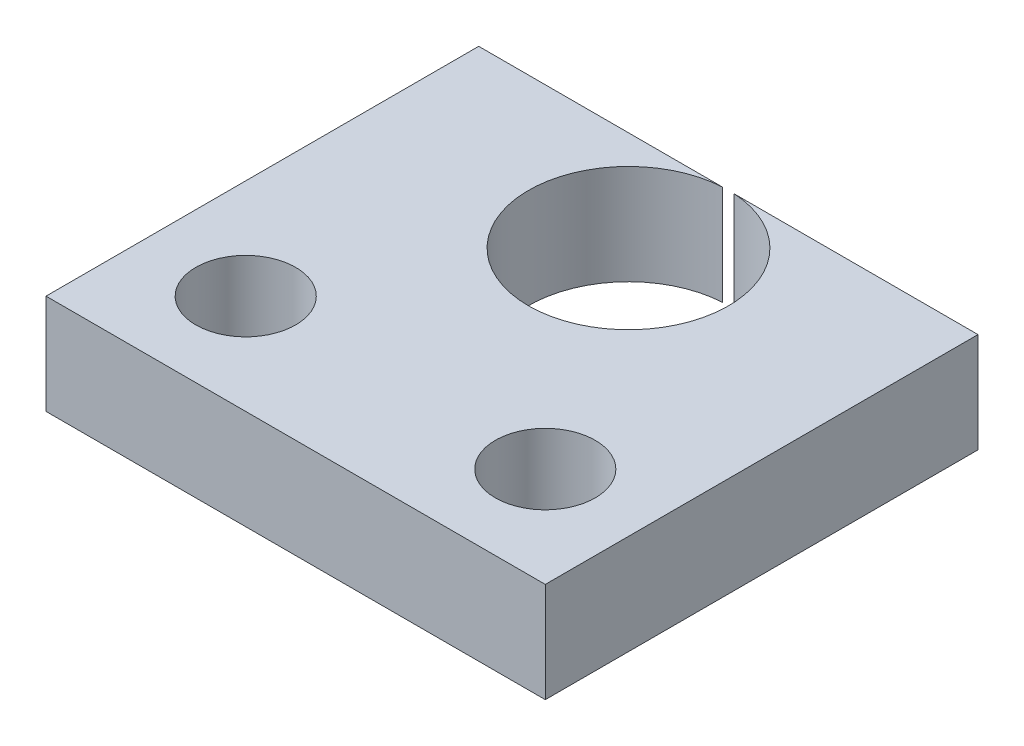
ISO-10303-21;
HEADER;
FILE_DESCRIPTION(('STEP AP214'),'2;1');
FILE_NAME('part.step','',(''),(''),'','','');
FILE_SCHEMA(('AUTOMOTIVE_DESIGN { 1 0 10303 214 1 1 1 1 }'));
ENDSEC;
DATA;
#1=APPLICATION_CONTEXT('core data for automotive mechanical design processes');
#2=APPLICATION_PROTOCOL_DEFINITION('international standard','automotive_design',2000,#1);
#3=PRODUCT_CONTEXT('',#1,'mechanical');
#4=PRODUCT('Part','Part','',(#3));
#5=PRODUCT_RELATED_PRODUCT_CATEGORY('part','',(#4));
#6=PRODUCT_DEFINITION_FORMATION('','',#4);
#7=PRODUCT_DEFINITION_CONTEXT('part definition',#1,'design');
#8=PRODUCT_DEFINITION('design','',#6,#7);
#9=PRODUCT_DEFINITION_SHAPE('','',#8);
#10=(LENGTH_UNIT() NAMED_UNIT(*) SI_UNIT(.MILLI.,.METRE.));
#11=(NAMED_UNIT(*) PLANE_ANGLE_UNIT() SI_UNIT($,.RADIAN.));
#12=(NAMED_UNIT(*) SI_UNIT($,.STERADIAN.) SOLID_ANGLE_UNIT());
#13=UNCERTAINTY_MEASURE_WITH_UNIT(LENGTH_MEASURE(1.E-05),#10,'distance_accuracy_value','');
#14=(GEOMETRIC_REPRESENTATION_CONTEXT(3) GLOBAL_UNCERTAINTY_ASSIGNED_CONTEXT((#13)) GLOBAL_UNIT_ASSIGNED_CONTEXT((#10,
#11,#12)) REPRESENTATION_CONTEXT('',''));
#15=CARTESIAN_POINT('',(0.,0.,0.));
#16=DIRECTION('',(0.,0.,1.));
#17=DIRECTION('',(1.,0.,0.));
#18=AXIS2_PLACEMENT_3D('',#15,#16,#17);
#19=CARTESIAN_POINT('',(-7.5,3.,-7.));
#20=DIRECTION('',(0.,0.,1.));
#21=DIRECTION('',(1.,0.,0.));
#22=AXIS2_PLACEMENT_3D('',#19,#20,#21);
#23=PLANE('',#22);
#24=DIRECTION('',(-1.,0.,0.));
#25=VECTOR('',#24,1.);
#26=CARTESIAN_POINT('',(-7.5,0.,-7.));
#27=LINE('',#26,#25);
#28=CARTESIAN_POINT('',(7.5,0.,-7.));
#29=VERTEX_POINT('',#28);
#30=CARTESIAN_POINT('',(0.173277234511575,0.,-7.));
#31=VERTEX_POINT('',#30);
#32=EDGE_CURVE('E106',#29,#31,#27,.T.);
#33=ORIENTED_EDGE('',*,*,#32,.T.);
#34=DIRECTION('',(0.,1.,0.));
#35=VECTOR('',#34,1.);
#36=CARTESIAN_POINT('',(0.173277234511575,0.,-7.));
#37=LINE('',#36,#35);
#38=CARTESIAN_POINT('',(0.173277234511575,3.,-7.));
#39=VERTEX_POINT('',#38);
#40=EDGE_CURVE('E50',#31,#39,#37,.T.);
#41=ORIENTED_EDGE('',*,*,#40,.T.);
#42=DIRECTION('',(-1.,0.,0.));
#43=VECTOR('',#42,1.);
#44=CARTESIAN_POINT('',(-7.5,3.,-7.));
#45=LINE('',#44,#43);
#46=CARTESIAN_POINT('',(7.5,3.,-7.));
#47=VERTEX_POINT('',#46);
#48=EDGE_CURVE('E128',#47,#39,#45,.T.);
#49=ORIENTED_EDGE('',*,*,#48,.F.);
#50=DIRECTION('',(0.,-1.,0.));
#51=VECTOR('',#50,1.);
#52=CARTESIAN_POINT('',(7.5,3.,-7.));
#53=LINE('',#52,#51);
#54=EDGE_CURVE('E153',#47,#29,#53,.T.);
#55=ORIENTED_EDGE('',*,*,#54,.T.);
#56=EDGE_LOOP('',(#33,#41,#49,#55));
#57=FACE_BOUND('',#56,.T.);
#58=ADVANCED_FACE('F32',(#57),#23,.F.);
#59=CARTESIAN_POINT('',(-7.5,3.,-7.));
#60=DIRECTION('',(1.,0.,0.));
#61=DIRECTION('',(0.,0.,-1.));
#62=AXIS2_PLACEMENT_3D('',#59,#60,#61);
#63=PLANE('',#62);
#64=DIRECTION('',(0.,0.,1.));
#65=VECTOR('',#64,1.);
#66=CARTESIAN_POINT('',(-7.5,0.,-7.));
#67=LINE('',#66,#65);
#68=CARTESIAN_POINT('',(-7.5,0.,-7.));
#69=VERTEX_POINT('',#68);
#70=CARTESIAN_POINT('',(-7.5,0.,6.));
#71=VERTEX_POINT('',#70);
#72=EDGE_CURVE('E105',#69,#71,#67,.T.);
#73=ORIENTED_EDGE('',*,*,#72,.T.);
#74=DIRECTION('',(0.,-1.,0.));
#75=VECTOR('',#74,1.);
#76=CARTESIAN_POINT('',(-7.5,3.,6.));
#77=LINE('',#76,#75);
#78=CARTESIAN_POINT('',(-7.5,3.,6.));
#79=VERTEX_POINT('',#78);
#80=EDGE_CURVE('E42',#79,#71,#77,.T.);
#81=ORIENTED_EDGE('',*,*,#80,.F.);
#82=DIRECTION('',(0.,0.,1.));
#83=VECTOR('',#82,1.);
#84=CARTESIAN_POINT('',(-7.5,3.,-7.));
#85=LINE('',#84,#83);
#86=CARTESIAN_POINT('',(-7.5,3.,-7.));
#87=VERTEX_POINT('',#86);
#88=EDGE_CURVE('E108',#87,#79,#85,.T.);
#89=ORIENTED_EDGE('',*,*,#88,.F.);
#90=DIRECTION('',(0.,-1.,0.));
#91=VECTOR('',#90,1.);
#92=CARTESIAN_POINT('',(-7.5,3.,-7.));
#93=LINE('',#92,#91);
#94=EDGE_CURVE('E120',#87,#69,#93,.T.);
#95=ORIENTED_EDGE('',*,*,#94,.T.);
#96=EDGE_LOOP('',(#73,#81,#89,#95));
#97=FACE_BOUND('',#96,.T.);
#98=ADVANCED_FACE('F34',(#97),#63,.F.);
#99=CARTESIAN_POINT('',(-7.5,3.,6.));
#100=DIRECTION('',(0.,0.,-1.));
#101=DIRECTION('',(-1.,0.,0.));
#102=AXIS2_PLACEMENT_3D('',#99,#100,#101);
#103=PLANE('',#102);
#104=DIRECTION('',(1.,0.,0.));
#105=VECTOR('',#104,1.);
#106=CARTESIAN_POINT('',(-7.5,0.,6.));
#107=LINE('',#106,#105);
#108=CARTESIAN_POINT('',(7.5,0.,6.));
#109=VERTEX_POINT('',#108);
#110=EDGE_CURVE('E109',#71,#109,#107,.T.);
#111=ORIENTED_EDGE('',*,*,#110,.T.);
#112=DIRECTION('',(0.,-1.,0.));
#113=VECTOR('',#112,1.);
#114=CARTESIAN_POINT('',(7.5,3.,6.));
#115=LINE('',#114,#113);
#116=CARTESIAN_POINT('',(7.5,3.,6.));
#117=VERTEX_POINT('',#116);
#118=EDGE_CURVE('E155',#117,#109,#115,.T.);
#119=ORIENTED_EDGE('',*,*,#118,.F.);
#120=DIRECTION('',(1.,0.,0.));
#121=VECTOR('',#120,1.);
#122=CARTESIAN_POINT('',(-7.5,3.,6.));
#123=LINE('',#122,#121);
#124=EDGE_CURVE('E87',#79,#117,#123,.T.);
#125=ORIENTED_EDGE('',*,*,#124,.F.);
#126=ORIENTED_EDGE('',*,*,#80,.T.);
#127=EDGE_LOOP('',(#111,#119,#125,#126));
#128=FACE_BOUND('',#127,.T.);
#129=ADVANCED_FACE('F157',(#128),#103,.F.);
#130=CARTESIAN_POINT('',(7.5,3.,-7.));
#131=DIRECTION('',(-1.,0.,0.));
#132=DIRECTION('',(0.,0.,1.));
#133=AXIS2_PLACEMENT_3D('',#130,#131,#132);
#134=PLANE('',#133);
#135=DIRECTION('',(0.,0.,-1.));
#136=VECTOR('',#135,1.);
#137=CARTESIAN_POINT('',(7.5,0.,-7.));
#138=LINE('',#137,#136);
#139=EDGE_CURVE('E107',#109,#29,#138,.T.);
#140=ORIENTED_EDGE('',*,*,#139,.T.);
#141=ORIENTED_EDGE('',*,*,#54,.F.);
#142=DIRECTION('',(0.,0.,-1.));
#143=VECTOR('',#142,1.);
#144=CARTESIAN_POINT('',(7.5,3.,-7.));
#145=LINE('',#144,#143);
#146=EDGE_CURVE('E129',#117,#47,#145,.T.);
#147=ORIENTED_EDGE('',*,*,#146,.F.);
#148=ORIENTED_EDGE('',*,*,#118,.T.);
#149=EDGE_LOOP('',(#140,#141,#147,#148));
#150=FACE_BOUND('',#149,.T.);
#151=ADVANCED_FACE('F154',(#150),#134,.F.);
#152=CARTESIAN_POINT('',(-0.173277234511575,3.,-7.));
#153=VERTEX_POINT('',#152);
#154=EDGE_CURVE('E58',#153,#87,#45,.T.);
#155=ORIENTED_EDGE('',*,*,#154,.F.);
#156=DIRECTION('',(0.,1.,0.));
#157=VECTOR('',#156,1.);
#158=CARTESIAN_POINT('',(-0.173277234511575,0.,-7.));
#159=LINE('',#158,#157);
#160=CARTESIAN_POINT('',(-0.173277234511575,0.,-7.));
#161=VERTEX_POINT('',#160);
#162=EDGE_CURVE('E95',#153,#161,#159,.F.);
#163=ORIENTED_EDGE('',*,*,#162,.T.);
#164=EDGE_CURVE('E36',#161,#69,#27,.T.);
#165=ORIENTED_EDGE('',*,*,#164,.T.);
#166=ORIENTED_EDGE('',*,*,#94,.F.);
#167=EDGE_LOOP('',(#155,#163,#165,#166));
#168=FACE_BOUND('',#167,.T.);
#169=ADVANCED_FACE('F99',(#168),#23,.F.);
#170=CARTESIAN_POINT('',(0.,3.,0.));
#171=DIRECTION('',(0.,1.,0.));
#172=DIRECTION('',(0.,0.,1.));
#173=AXIS2_PLACEMENT_3D('',#170,#171,#172);
#174=PLANE('',#173);
#175=CARTESIAN_POINT('',(4.5,3.,3.));
#176=DIRECTION('',(0.,1.,0.));
#177=DIRECTION('',(0.,0.,1.));
#178=AXIS2_PLACEMENT_3D('',#175,#176,#177);
#179=CIRCLE('',#178,1.5);
#180=CARTESIAN_POINT('',(4.5,3.,4.5));
#181=VERTEX_POINT('',#180);
#182=EDGE_CURVE('E198',#181,#181,#179,.T.);
#183=ORIENTED_EDGE('',*,*,#182,.F.);
#184=EDGE_LOOP('',(#183));
#185=FACE_BOUND('',#184,.T.);
#186=CARTESIAN_POINT('',(-4.5,3.,3.));
#187=DIRECTION('',(0.,1.,0.));
#188=DIRECTION('',(0.,0.,1.));
#189=AXIS2_PLACEMENT_3D('',#186,#187,#188);
#190=CIRCLE('',#189,1.5);
#191=CARTESIAN_POINT('',(-4.5,3.,4.5));
#192=VERTEX_POINT('',#191);
#193=EDGE_CURVE('E200',#192,#192,#190,.T.);
#194=ORIENTED_EDGE('',*,*,#193,.F.);
#195=EDGE_LOOP('',(#194));
#196=FACE_BOUND('',#195,.T.);
#197=CARTESIAN_POINT('',(0.,3.,-4.));
#198=DIRECTION('',(0.,1.,0.));
#199=DIRECTION('',(0.,0.,1.));
#200=AXIS2_PLACEMENT_3D('',#197,#198,#199);
#201=CIRCLE('',#200,3.005);
#202=EDGE_CURVE('E100',#153,#39,#201,.T.);
#203=ORIENTED_EDGE('',*,*,#202,.F.);
#204=ORIENTED_EDGE('',*,*,#154,.T.);
#205=ORIENTED_EDGE('',*,*,#88,.T.);
#206=ORIENTED_EDGE('',*,*,#124,.T.);
#207=ORIENTED_EDGE('',*,*,#146,.T.);
#208=ORIENTED_EDGE('',*,*,#48,.T.);
#209=EDGE_LOOP('',(#203,#204,#205,#206,#207,#208));
#210=FACE_BOUND('',#209,.T.);
#211=ADVANCED_FACE('F152',(#185,#196,#210),#174,.T.);
#212=CARTESIAN_POINT('',(0.,0.,0.));
#213=DIRECTION('',(0.,1.,0.));
#214=DIRECTION('',(0.,0.,1.));
#215=AXIS2_PLACEMENT_3D('',#212,#213,#214);
#216=PLANE('',#215);
#217=CARTESIAN_POINT('',(4.5,0.,3.));
#218=DIRECTION('',(0.,1.,0.));
#219=DIRECTION('',(0.,0.,1.));
#220=AXIS2_PLACEMENT_3D('',#217,#218,#219);
#221=CIRCLE('',#220,1.5);
#222=CARTESIAN_POINT('',(4.5,0.,4.5));
#223=VERTEX_POINT('',#222);
#224=EDGE_CURVE('E196',#223,#223,#221,.T.);
#225=ORIENTED_EDGE('',*,*,#224,.T.);
#226=EDGE_LOOP('',(#225));
#227=FACE_BOUND('',#226,.T.);
#228=CARTESIAN_POINT('',(-4.5,0.,3.));
#229=DIRECTION('',(0.,1.,0.));
#230=DIRECTION('',(0.,0.,1.));
#231=AXIS2_PLACEMENT_3D('',#228,#229,#230);
#232=CIRCLE('',#231,1.5);
#233=CARTESIAN_POINT('',(-4.5,0.,4.5));
#234=VERTEX_POINT('',#233);
#235=EDGE_CURVE('E203',#234,#234,#232,.T.);
#236=ORIENTED_EDGE('',*,*,#235,.T.);
#237=EDGE_LOOP('',(#236));
#238=FACE_BOUND('',#237,.T.);
#239=ORIENTED_EDGE('',*,*,#164,.F.);
#240=CARTESIAN_POINT('',(0.,0.,-4.));
#241=DIRECTION('',(0.,1.,0.));
#242=DIRECTION('',(0.,0.,1.));
#243=AXIS2_PLACEMENT_3D('',#240,#241,#242);
#244=CIRCLE('',#243,3.005);
#245=EDGE_CURVE('E11',#161,#31,#244,.T.);
#246=ORIENTED_EDGE('',*,*,#245,.T.);
#247=ORIENTED_EDGE('',*,*,#32,.F.);
#248=ORIENTED_EDGE('',*,*,#139,.F.);
#249=ORIENTED_EDGE('',*,*,#110,.F.);
#250=ORIENTED_EDGE('',*,*,#72,.F.);
#251=EDGE_LOOP('',(#239,#246,#247,#248,#249,#250));
#252=FACE_BOUND('',#251,.T.);
#253=ADVANCED_FACE('F103',(#227,#238,#252),#216,.F.);
#254=CARTESIAN_POINT('',(0.,0.,-4.));
#255=DIRECTION('',(0.,1.,0.));
#256=DIRECTION('',(0.,0.,1.));
#257=AXIS2_PLACEMENT_3D('',#254,#255,#256);
#258=CYLINDRICAL_SURFACE('',#257,3.005);
#259=ORIENTED_EDGE('',*,*,#245,.F.);
#260=ORIENTED_EDGE('',*,*,#162,.F.);
#261=ORIENTED_EDGE('',*,*,#202,.T.);
#262=ORIENTED_EDGE('',*,*,#40,.F.);
#263=EDGE_LOOP('',(#259,#260,#261,#262));
#264=FACE_BOUND('',#263,.T.);
#265=ADVANCED_FACE('F94',(#264),#258,.F.);
#266=CARTESIAN_POINT('',(-4.5,0.,3.));
#267=DIRECTION('',(0.,1.,0.));
#268=DIRECTION('',(0.,0.,1.));
#269=AXIS2_PLACEMENT_3D('',#266,#267,#268);
#270=CYLINDRICAL_SURFACE('',#269,1.5);
#271=ORIENTED_EDGE('',*,*,#235,.F.);
#272=EDGE_LOOP('',(#271));
#273=FACE_BOUND('',#272,.T.);
#274=ORIENTED_EDGE('',*,*,#193,.T.);
#275=EDGE_LOOP('',(#274));
#276=FACE_BOUND('',#275,.T.);
#277=ADVANCED_FACE('F184',(#273,#276),#270,.F.);
#278=CARTESIAN_POINT('',(4.5,0.,3.));
#279=DIRECTION('',(0.,1.,0.));
#280=DIRECTION('',(0.,0.,1.));
#281=AXIS2_PLACEMENT_3D('',#278,#279,#280);
#282=CYLINDRICAL_SURFACE('',#281,1.5);
#283=ORIENTED_EDGE('',*,*,#224,.F.);
#284=EDGE_LOOP('',(#283));
#285=FACE_BOUND('',#284,.T.);
#286=ORIENTED_EDGE('',*,*,#182,.T.);
#287=EDGE_LOOP('',(#286));
#288=FACE_BOUND('',#287,.T.);
#289=ADVANCED_FACE('F187',(#285,#288),#282,.F.);
#290=CLOSED_SHELL('',(#58,#98,#129,#151,#169,#211,#253,#265,#277,#289));
#291=MANIFOLD_SOLID_BREP('B2',#290);
#292=ADVANCED_BREP_SHAPE_REPRESENTATION('',(#18,#291),#14);
#293=SHAPE_DEFINITION_REPRESENTATION(#9,#292);
ENDSEC;
END-ISO-10303-21;
